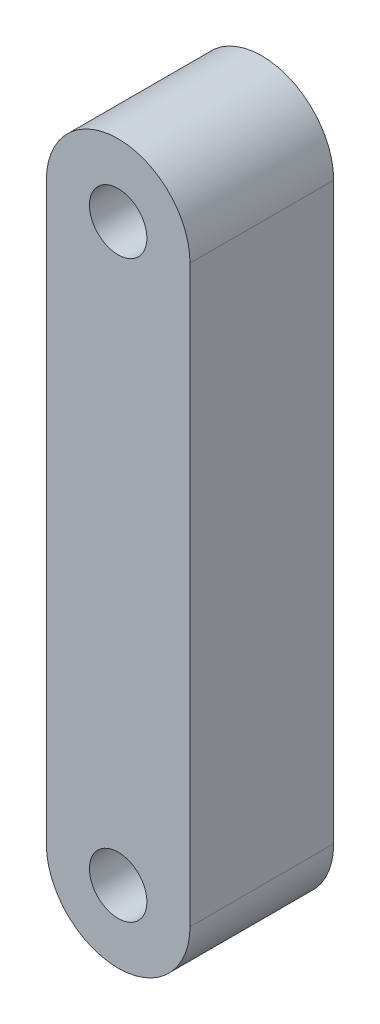
ISO-10303-21;
HEADER;
FILE_DESCRIPTION(('STEP AP214'),'2;1');
FILE_NAME('part.step','',(''),(''),'','','');
FILE_SCHEMA(('AUTOMOTIVE_DESIGN { 1 0 10303 214 1 1 1 1 }'));
ENDSEC;
DATA;
#1=APPLICATION_CONTEXT('core data for automotive mechanical design processes');
#2=APPLICATION_PROTOCOL_DEFINITION('international standard','automotive_design',2000,#1);
#3=PRODUCT_CONTEXT('',#1,'mechanical');
#4=PRODUCT('Part','Part','',(#3));
#5=PRODUCT_RELATED_PRODUCT_CATEGORY('part','',(#4));
#6=PRODUCT_DEFINITION_FORMATION('','',#4);
#7=PRODUCT_DEFINITION_CONTEXT('part definition',#1,'design');
#8=PRODUCT_DEFINITION('design','',#6,#7);
#9=PRODUCT_DEFINITION_SHAPE('','',#8);
#10=(LENGTH_UNIT() NAMED_UNIT(*) SI_UNIT(.MILLI.,.METRE.));
#11=(NAMED_UNIT(*) PLANE_ANGLE_UNIT() SI_UNIT($,.RADIAN.));
#12=(NAMED_UNIT(*) SI_UNIT($,.STERADIAN.) SOLID_ANGLE_UNIT());
#13=UNCERTAINTY_MEASURE_WITH_UNIT(LENGTH_MEASURE(1.E-05),#10,'distance_accuracy_value','');
#14=(GEOMETRIC_REPRESENTATION_CONTEXT(3) GLOBAL_UNCERTAINTY_ASSIGNED_CONTEXT((#13)) GLOBAL_UNIT_ASSIGNED_CONTEXT((#10,
#11,#12)) REPRESENTATION_CONTEXT('',''));
#15=CARTESIAN_POINT('',(0.,0.,0.));
#16=DIRECTION('',(0.,0.,1.));
#17=DIRECTION('',(1.,0.,0.));
#18=AXIS2_PLACEMENT_3D('',#15,#16,#17);
#19=CARTESIAN_POINT('',(0.,39.9999999999998,10.0000000000001));
#20=DIRECTION('',(0.,0.,0.999999999999964));
#21=DIRECTION('',(0.99999999999999,0.,0.));
#22=AXIS2_PLACEMENT_3D('',#19,#20,#21);
#23=PLANE('',#22);
#24=CARTESIAN_POINT('',(0.,-9.99200722162641E-13,10.0000000000003));
#25=DIRECTION('',(0.,0.,0.999999999999964));
#26=DIRECTION('',(0.99999999999999,0.,0.));
#27=AXIS2_PLACEMENT_3D('',#24,#25,#26);
#28=CIRCLE('',#27,2.);
#29=CARTESIAN_POINT('',(2.00000000000004,-9.98534588347866E-13,10.0000000000003));
#30=VERTEX_POINT('',#29);
#31=EDGE_CURVE('E101',#30,#30,#28,.T.);
#32=ORIENTED_EDGE('',*,*,#31,.F.);
#33=EDGE_LOOP('',(#32));
#34=FACE_BOUND('',#33,.T.);
#35=CARTESIAN_POINT('',(0.,39.9999999999998,10.0000000000001));
#36=DIRECTION('',(0.,0.,0.999999999999964));
#37=DIRECTION('',(0.99999999999999,0.,0.));
#38=AXIS2_PLACEMENT_3D('',#35,#36,#37);
#39=CIRCLE('',#38,5.);
#40=CARTESIAN_POINT('',(5.00000000000045,39.9999999999995,9.9999999999997));
#41=VERTEX_POINT('',#40);
#42=CARTESIAN_POINT('',(-4.99999999999967,39.9999999999998,10.0000000000005));
#43=VERTEX_POINT('',#42);
#44=EDGE_CURVE('E86',#41,#43,#39,.T.);
#45=ORIENTED_EDGE('',*,*,#44,.T.);
#46=DIRECTION('',(0.,-1.,0.));
#47=VECTOR('',#46,1.);
#48=CARTESIAN_POINT('',(-4.99999999999967,39.9999999999998,10.0000000000005));
#49=LINE('',#48,#47);
#50=CARTESIAN_POINT('',(-4.99999999999967,0.,10.0000000000004));
#51=VERTEX_POINT('',#50);
#52=EDGE_CURVE('E81',#43,#51,#49,.T.);
#53=ORIENTED_EDGE('',*,*,#52,.T.);
#54=CARTESIAN_POINT('',(0.,-9.99200722162641E-13,10.0000000000003));
#55=DIRECTION('',(0.,0.,0.999999999999964));
#56=DIRECTION('',(0.99999999999999,0.,0.));
#57=AXIS2_PLACEMENT_3D('',#54,#55,#56);
#58=CIRCLE('',#57,5.);
#59=CARTESIAN_POINT('',(4.99999999999984,3.88578058618805E-13,9.99999999999985));
#60=VERTEX_POINT('',#59);
#61=EDGE_CURVE('E84',#51,#60,#58,.T.);
#62=ORIENTED_EDGE('',*,*,#61,.T.);
#63=DIRECTION('',(0.,1.,0.));
#64=VECTOR('',#63,1.);
#65=CARTESIAN_POINT('',(4.99999999999984,3.88578058618805E-13,9.99999999999985));
#66=LINE('',#65,#64);
#67=EDGE_CURVE('E51',#60,#41,#66,.T.);
#68=ORIENTED_EDGE('',*,*,#67,.T.);
#69=EDGE_LOOP('',(#45,#53,#62,#68));
#70=FACE_BOUND('',#69,.T.);
#71=CARTESIAN_POINT('',(0.,39.9999999999998,10.0000000000001));
#72=DIRECTION('',(0.,0.,0.999999999999964));
#73=DIRECTION('',(0.99999999999999,0.,0.));
#74=AXIS2_PLACEMENT_3D('',#71,#72,#73);
#75=CIRCLE('',#74,2.);
#76=CARTESIAN_POINT('',(2.00000000000004,39.9999999999998,10.0000000000001));
#77=VERTEX_POINT('',#76);
#78=EDGE_CURVE('E116',#77,#77,#75,.T.);
#79=ORIENTED_EDGE('',*,*,#78,.F.);
#80=EDGE_LOOP('',(#79));
#81=FACE_BOUND('',#80,.T.);
#82=ADVANCED_FACE('F34',(#34,#70,#81),#23,.T.);
#83=CARTESIAN_POINT('',(0.,39.9999999999997,0.));
#84=DIRECTION('',(0.,0.,0.999999999999964));
#85=DIRECTION('',(0.99999999999999,0.,0.));
#86=AXIS2_PLACEMENT_3D('',#83,#84,#85);
#87=PLANE('',#86);
#88=CARTESIAN_POINT('',(0.,39.9999999999997,0.));
#89=DIRECTION('',(0.,0.,0.999999999999964));
#90=DIRECTION('',(0.99999999999999,0.,0.));
#91=AXIS2_PLACEMENT_3D('',#88,#89,#90);
#92=CIRCLE('',#91,5.);
#93=CARTESIAN_POINT('',(5.00000000000012,39.9999999999996,-2.91433543964104E-13));
#94=VERTEX_POINT('',#93);
#95=CARTESIAN_POINT('',(-4.99999999999967,40.0000000000001,4.71844785465692E-13));
#96=VERTEX_POINT('',#95);
#97=EDGE_CURVE('E98',#94,#96,#92,.T.);
#98=ORIENTED_EDGE('',*,*,#97,.F.);
#99=DIRECTION('',(0.,1.,0.));
#100=VECTOR('',#99,1.);
#101=CARTESIAN_POINT('',(4.99999999999989,0.,7.63278329429795E-13));
#102=LINE('',#101,#100);
#103=CARTESIAN_POINT('',(4.99999999999989,0.,7.63278329429795E-13));
#104=VERTEX_POINT('',#103);
#105=EDGE_CURVE('E74',#104,#94,#102,.T.);
#106=ORIENTED_EDGE('',*,*,#105,.F.);
#107=CARTESIAN_POINT('',(0.,0.,0.));
#108=DIRECTION('',(0.,0.,0.999999999999964));
#109=DIRECTION('',(0.99999999999999,0.,0.));
#110=AXIS2_PLACEMENT_3D('',#107,#108,#109);
#111=CIRCLE('',#110,5.);
#112=CARTESIAN_POINT('',(-5.,1.66533453693773E-13,7.91033905045424E-13));
#113=VERTEX_POINT('',#112);
#114=EDGE_CURVE('E68',#113,#104,#111,.T.);
#115=ORIENTED_EDGE('',*,*,#114,.F.);
#116=DIRECTION('',(0.,-1.,0.));
#117=VECTOR('',#116,1.);
#118=CARTESIAN_POINT('',(-4.99999999999967,40.0000000000001,4.71844785465692E-13));
#119=LINE('',#118,#117);
#120=EDGE_CURVE('E90',#96,#113,#119,.T.);
#121=ORIENTED_EDGE('',*,*,#120,.F.);
#122=EDGE_LOOP('',(#98,#106,#115,#121));
#123=FACE_BOUND('',#122,.T.);
#124=CARTESIAN_POINT('',(0.,0.,0.));
#125=DIRECTION('',(0.,0.,0.999999999999964));
#126=DIRECTION('',(0.99999999999999,0.,0.));
#127=AXIS2_PLACEMENT_3D('',#124,#125,#126);
#128=CIRCLE('',#127,2.);
#129=CARTESIAN_POINT('',(1.99999999999998,0.,0.));
#130=VERTEX_POINT('',#129);
#131=EDGE_CURVE('E113',#130,#130,#128,.T.);
#132=ORIENTED_EDGE('',*,*,#131,.T.);
#133=EDGE_LOOP('',(#132));
#134=FACE_BOUND('',#133,.T.);
#135=CARTESIAN_POINT('',(0.,39.9999999999997,0.));
#136=DIRECTION('',(0.,0.,0.999999999999964));
#137=DIRECTION('',(0.99999999999999,0.,0.));
#138=AXIS2_PLACEMENT_3D('',#135,#136,#137);
#139=CIRCLE('',#138,2.);
#140=CARTESIAN_POINT('',(2.00000000000004,39.9999999999997,0.));
#141=VERTEX_POINT('',#140);
#142=EDGE_CURVE('E119',#141,#141,#139,.T.);
#143=ORIENTED_EDGE('',*,*,#142,.T.);
#144=EDGE_LOOP('',(#143));
#145=FACE_BOUND('',#144,.T.);
#146=ADVANCED_FACE('F109',(#123,#134,#145),#87,.F.);
#147=CARTESIAN_POINT('',(0.,39.9999999999998,10.0000000000001));
#148=DIRECTION('',(0.,0.,-0.999999999999964));
#149=DIRECTION('',(-0.99999999999999,0.,0.));
#150=AXIS2_PLACEMENT_3D('',#147,#148,#149);
#151=CYLINDRICAL_SURFACE('',#150,5.);
#152=ORIENTED_EDGE('',*,*,#97,.T.);
#153=DIRECTION('',(0.,0.,-0.999999999999964));
#154=VECTOR('',#153,1.);
#155=CARTESIAN_POINT('',(-4.99999999999967,39.9999999999998,10.0000000000005));
#156=LINE('',#155,#154);
#157=EDGE_CURVE('E11',#43,#96,#156,.T.);
#158=ORIENTED_EDGE('',*,*,#157,.F.);
#159=ORIENTED_EDGE('',*,*,#44,.F.);
#160=DIRECTION('',(0.,0.,-0.999999999999964));
#161=VECTOR('',#160,1.);
#162=CARTESIAN_POINT('',(5.00000000000045,39.9999999999995,9.9999999999997));
#163=LINE('',#162,#161);
#164=EDGE_CURVE('E94',#41,#94,#163,.T.);
#165=ORIENTED_EDGE('',*,*,#164,.T.);
#166=EDGE_LOOP('',(#152,#158,#159,#165));
#167=FACE_BOUND('',#166,.T.);
#168=ADVANCED_FACE('F36',(#167),#151,.T.);
#169=CARTESIAN_POINT('',(-4.99999999999967,39.9999999999998,10.0000000000005));
#170=DIRECTION('',(0.99999999999999,0.,0.));
#171=DIRECTION('',(0.,0.,-0.999999999999964));
#172=AXIS2_PLACEMENT_3D('',#169,#170,#171);
#173=PLANE('',#172);
#174=ORIENTED_EDGE('',*,*,#120,.T.);
#175=DIRECTION('',(0.,0.,-0.999999999999964));
#176=VECTOR('',#175,1.);
#177=CARTESIAN_POINT('',(-4.99999999999967,0.,10.0000000000004));
#178=LINE('',#177,#176);
#179=EDGE_CURVE('E43',#51,#113,#178,.T.);
#180=ORIENTED_EDGE('',*,*,#179,.F.);
#181=ORIENTED_EDGE('',*,*,#52,.F.);
#182=ORIENTED_EDGE('',*,*,#157,.T.);
#183=EDGE_LOOP('',(#174,#180,#181,#182));
#184=FACE_BOUND('',#183,.T.);
#185=ADVANCED_FACE('F89',(#184),#173,.F.);
#186=CARTESIAN_POINT('',(0.,-9.99200722162641E-13,10.0000000000003));
#187=DIRECTION('',(0.,0.,-0.999999999999964));
#188=DIRECTION('',(-0.99999999999999,0.,0.));
#189=AXIS2_PLACEMENT_3D('',#186,#187,#188);
#190=CYLINDRICAL_SURFACE('',#189,5.);
#191=ORIENTED_EDGE('',*,*,#114,.T.);
#192=DIRECTION('',(0.,0.,-0.999999999999964));
#193=VECTOR('',#192,1.);
#194=CARTESIAN_POINT('',(4.99999999999984,3.88578058618805E-13,9.99999999999985));
#195=LINE('',#194,#193);
#196=EDGE_CURVE('E91',#60,#104,#195,.T.);
#197=ORIENTED_EDGE('',*,*,#196,.F.);
#198=ORIENTED_EDGE('',*,*,#61,.F.);
#199=ORIENTED_EDGE('',*,*,#179,.T.);
#200=EDGE_LOOP('',(#191,#197,#198,#199));
#201=FACE_BOUND('',#200,.T.);
#202=ADVANCED_FACE('F92',(#201),#190,.T.);
#203=CARTESIAN_POINT('',(4.99999999999984,3.88578058618805E-13,9.99999999999985));
#204=DIRECTION('',(-0.99999999999999,0.,0.));
#205=DIRECTION('',(0.,0.,0.999999999999964));
#206=AXIS2_PLACEMENT_3D('',#203,#204,#205);
#207=PLANE('',#206);
#208=ORIENTED_EDGE('',*,*,#105,.T.);
#209=ORIENTED_EDGE('',*,*,#164,.F.);
#210=ORIENTED_EDGE('',*,*,#67,.F.);
#211=ORIENTED_EDGE('',*,*,#196,.T.);
#212=EDGE_LOOP('',(#208,#209,#210,#211));
#213=FACE_BOUND('',#212,.T.);
#214=ADVANCED_FACE('F106',(#213),#207,.F.);
#215=CARTESIAN_POINT('',(0.,-9.99200722162641E-13,10.0000000000003));
#216=DIRECTION('',(0.,0.,-0.999999999999964));
#217=DIRECTION('',(-0.99999999999999,0.,0.));
#218=AXIS2_PLACEMENT_3D('',#215,#216,#217);
#219=CYLINDRICAL_SURFACE('',#218,2.);
#220=ORIENTED_EDGE('',*,*,#31,.T.);
#221=EDGE_LOOP('',(#220));
#222=FACE_BOUND('',#221,.T.);
#223=ORIENTED_EDGE('',*,*,#131,.F.);
#224=EDGE_LOOP('',(#223));
#225=FACE_BOUND('',#224,.T.);
#226=ADVANCED_FACE('F136',(#222,#225),#219,.F.);
#227=CARTESIAN_POINT('',(0.,39.9999999999998,10.0000000000001));
#228=DIRECTION('',(0.,0.,-0.999999999999964));
#229=DIRECTION('',(-0.99999999999999,0.,0.));
#230=AXIS2_PLACEMENT_3D('',#227,#228,#229);
#231=CYLINDRICAL_SURFACE('',#230,2.);
#232=ORIENTED_EDGE('',*,*,#78,.T.);
#233=EDGE_LOOP('',(#232));
#234=FACE_BOUND('',#233,.T.);
#235=ORIENTED_EDGE('',*,*,#142,.F.);
#236=EDGE_LOOP('',(#235));
#237=FACE_BOUND('',#236,.T.);
#238=ADVANCED_FACE('F125',(#234,#237),#231,.F.);
#239=CLOSED_SHELL('',(#82,#146,#168,#185,#202,#214,#226,#238));
#240=MANIFOLD_SOLID_BREP('B2',#239);
#241=ADVANCED_BREP_SHAPE_REPRESENTATION('',(#18,#240),#14);
#242=SHAPE_DEFINITION_REPRESENTATION(#9,#241);
ENDSEC;
END-ISO-10303-21;
